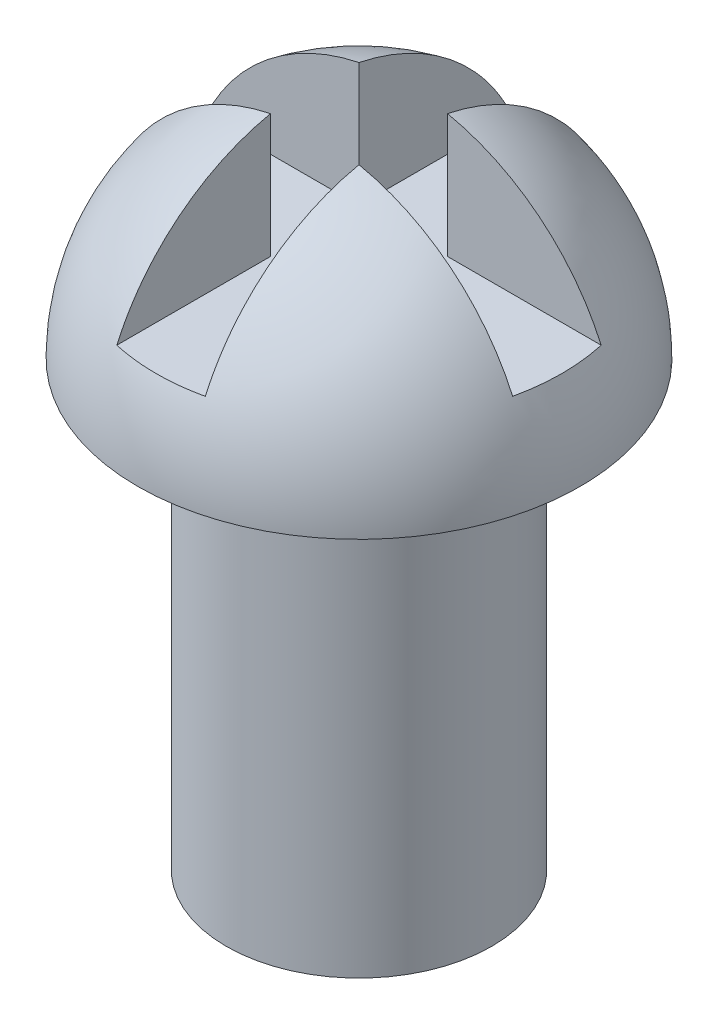
ISO-10303-21;
HEADER;
FILE_DESCRIPTION(('STEP AP214'),'2;1');
FILE_NAME('part.step','',(''),(''),'','','');
FILE_SCHEMA(('AUTOMOTIVE_DESIGN { 1 0 10303 214 1 1 1 1 }'));
ENDSEC;
DATA;
#1=APPLICATION_CONTEXT('core data for automotive mechanical design processes');
#2=APPLICATION_PROTOCOL_DEFINITION('international standard','automotive_design',2000,#1);
#3=PRODUCT_CONTEXT('',#1,'mechanical');
#4=PRODUCT('Part','Part','',(#3));
#5=PRODUCT_RELATED_PRODUCT_CATEGORY('part','',(#4));
#6=PRODUCT_DEFINITION_FORMATION('','',#4);
#7=PRODUCT_DEFINITION_CONTEXT('part definition',#1,'design');
#8=PRODUCT_DEFINITION('design','',#6,#7);
#9=PRODUCT_DEFINITION_SHAPE('','',#8);
#10=(LENGTH_UNIT() NAMED_UNIT(*) SI_UNIT(.MILLI.,.METRE.));
#11=(NAMED_UNIT(*) PLANE_ANGLE_UNIT() SI_UNIT($,.RADIAN.));
#12=(NAMED_UNIT(*) SI_UNIT($,.STERADIAN.) SOLID_ANGLE_UNIT());
#13=UNCERTAINTY_MEASURE_WITH_UNIT(LENGTH_MEASURE(1.E-05),#10,'distance_accuracy_value','');
#14=(GEOMETRIC_REPRESENTATION_CONTEXT(3) GLOBAL_UNCERTAINTY_ASSIGNED_CONTEXT((#13)) GLOBAL_UNIT_ASSIGNED_CONTEXT((#10,
#11,#12)) REPRESENTATION_CONTEXT('',''));
#15=CARTESIAN_POINT('',(0.,0.,0.));
#16=DIRECTION('',(0.,0.,1.));
#17=DIRECTION('',(1.,0.,0.));
#18=AXIS2_PLACEMENT_3D('',#15,#16,#17);
#19=CARTESIAN_POINT('',(0.,5.,0.));
#20=DIRECTION('',(0.,-1.,0.));
#21=DIRECTION('',(0.,0.,-1.));
#22=AXIS2_PLACEMENT_3D('',#19,#20,#21);
#23=CYLINDRICAL_SURFACE('',#22,1.5);
#24=CARTESIAN_POINT('',(0.,5.,0.));
#25=DIRECTION('',(0.,1.,0.));
#26=DIRECTION('',(0.,0.,1.));
#27=AXIS2_PLACEMENT_3D('',#24,#25,#26);
#28=CIRCLE('',#27,1.5);
#29=CARTESIAN_POINT('',(0.,5.,1.5));
#30=VERTEX_POINT('',#29);
#31=EDGE_CURVE('E162',#30,#30,#28,.T.);
#32=ORIENTED_EDGE('',*,*,#31,.F.);
#33=EDGE_LOOP('',(#32));
#34=FACE_BOUND('',#33,.T.);
#35=CARTESIAN_POINT('',(0.,0.,0.));
#36=DIRECTION('',(0.,1.,0.));
#37=DIRECTION('',(0.,0.,1.));
#38=AXIS2_PLACEMENT_3D('',#35,#36,#37);
#39=CIRCLE('',#38,1.5);
#40=CARTESIAN_POINT('',(0.,0.,1.5));
#41=VERTEX_POINT('',#40);
#42=EDGE_CURVE('E161',#41,#41,#39,.T.);
#43=ORIENTED_EDGE('',*,*,#42,.T.);
#44=EDGE_LOOP('',(#43));
#45=FACE_BOUND('',#44,.T.);
#46=ADVANCED_FACE('F39',(#34,#45),#23,.T.);
#47=CARTESIAN_POINT('',(0.,0.,0.));
#48=DIRECTION('',(0.,1.,0.));
#49=DIRECTION('',(0.,0.,1.));
#50=AXIS2_PLACEMENT_3D('',#47,#48,#49);
#51=PLANE('',#50);
#52=ORIENTED_EDGE('',*,*,#42,.F.);
#53=EDGE_LOOP('',(#52));
#54=FACE_BOUND('',#53,.T.);
#55=ADVANCED_FACE('F221',(#54),#51,.F.);
#56=CARTESIAN_POINT('',(0.,5.,0.));
#57=DIRECTION('',(0.,0.,-1.));
#58=DIRECTION('',(-1.,0.,0.));
#59=AXIS2_PLACEMENT_3D('',#56,#57,#58);
#60=SPHERICAL_SURFACE('',#59,2.5);
#61=CARTESIAN_POINT('',(0.,5.,-0.5));
#62=DIRECTION('',(0.,0.,-1.));
#63=DIRECTION('',(-1.,0.,0.));
#64=AXIS2_PLACEMENT_3D('',#61,#62,#63);
#65=CIRCLE('',#64,2.44948974278318);
#66=CARTESIAN_POINT('',(-2.23606797749979,6.,-0.5));
#67=VERTEX_POINT('',#66);
#68=CARTESIAN_POINT('',(-0.5,7.39791576165636,-0.5));
#69=VERTEX_POINT('',#68);
#70=EDGE_CURVE('E47',#67,#69,#65,.T.);
#71=ORIENTED_EDGE('',*,*,#70,.T.);
#72=CARTESIAN_POINT('',(-0.499999999999999,5.,0.));
#73=DIRECTION('',(-1.,0.,0.));
#74=DIRECTION('',(0.,0.,1.));
#75=AXIS2_PLACEMENT_3D('',#72,#73,#74);
#76=CIRCLE('',#75,2.44948974278318);
#77=CARTESIAN_POINT('',(-0.5,6.,-2.23606797749979));
#78=VERTEX_POINT('',#77);
#79=EDGE_CURVE('E11',#69,#78,#76,.T.);
#80=ORIENTED_EDGE('',*,*,#79,.T.);
#81=CARTESIAN_POINT('',(0.,6.,0.));
#82=DIRECTION('',(0.,1.,0.));
#83=DIRECTION('',(0.,0.,1.));
#84=AXIS2_PLACEMENT_3D('',#81,#82,#83);
#85=CIRCLE('',#84,2.29128784747792);
#86=CARTESIAN_POINT('',(0.5,6.,-2.23606797749979));
#87=VERTEX_POINT('',#86);
#88=EDGE_CURVE('E113',#87,#78,#85,.T.);
#89=ORIENTED_EDGE('',*,*,#88,.F.);
#90=CARTESIAN_POINT('',(0.5,5.,0.));
#91=DIRECTION('',(1.,0.,0.));
#92=DIRECTION('',(0.,0.,-1.));
#93=AXIS2_PLACEMENT_3D('',#90,#91,#92);
#94=CIRCLE('',#93,2.44948974278318);
#95=CARTESIAN_POINT('',(0.5,7.39791576165636,-0.5));
#96=VERTEX_POINT('',#95);
#97=EDGE_CURVE('E191',#87,#96,#94,.T.);
#98=ORIENTED_EDGE('',*,*,#97,.T.);
#99=CARTESIAN_POINT('',(0.,5.,-0.5));
#100=DIRECTION('',(0.,0.,-1.));
#101=DIRECTION('',(-1.,0.,0.));
#102=AXIS2_PLACEMENT_3D('',#99,#100,#101);
#103=CIRCLE('',#102,2.44948974278318);
#104=CARTESIAN_POINT('',(2.23606797749979,6.,-0.5));
#105=VERTEX_POINT('',#104);
#106=EDGE_CURVE('E62',#96,#105,#103,.T.);
#107=ORIENTED_EDGE('',*,*,#106,.T.);
#108=CARTESIAN_POINT('',(2.23606797749979,6.,0.5));
#109=VERTEX_POINT('',#108);
#110=EDGE_CURVE('E173',#109,#105,#85,.T.);
#111=ORIENTED_EDGE('',*,*,#110,.F.);
#112=CARTESIAN_POINT('',(0.,5.,0.5));
#113=DIRECTION('',(0.,0.,1.));
#114=DIRECTION('',(1.,0.,0.));
#115=AXIS2_PLACEMENT_3D('',#112,#113,#114);
#116=CIRCLE('',#115,2.44948974278318);
#117=CARTESIAN_POINT('',(0.5,7.39791576165636,0.5));
#118=VERTEX_POINT('',#117);
#119=EDGE_CURVE('E181',#109,#118,#116,.T.);
#120=ORIENTED_EDGE('',*,*,#119,.T.);
#121=CARTESIAN_POINT('',(0.5,5.,0.));
#122=DIRECTION('',(1.,0.,0.));
#123=DIRECTION('',(0.,0.,-1.));
#124=AXIS2_PLACEMENT_3D('',#121,#122,#123);
#125=CIRCLE('',#124,2.44948974278318);
#126=CARTESIAN_POINT('',(0.5,6.,2.23606797749979));
#127=VERTEX_POINT('',#126);
#128=EDGE_CURVE('E177',#118,#127,#125,.T.);
#129=ORIENTED_EDGE('',*,*,#128,.T.);
#130=CARTESIAN_POINT('',(-0.5,6.,2.23606797749979));
#131=VERTEX_POINT('',#130);
#132=EDGE_CURVE('E166',#131,#127,#85,.T.);
#133=ORIENTED_EDGE('',*,*,#132,.F.);
#134=CARTESIAN_POINT('',(-0.5,5.,0.));
#135=DIRECTION('',(-1.,0.,0.));
#136=DIRECTION('',(0.,0.,1.));
#137=AXIS2_PLACEMENT_3D('',#134,#135,#136);
#138=CIRCLE('',#137,2.44948974278318);
#139=CARTESIAN_POINT('',(-0.5,7.39791576165636,0.5));
#140=VERTEX_POINT('',#139);
#141=EDGE_CURVE('E172',#131,#140,#138,.T.);
#142=ORIENTED_EDGE('',*,*,#141,.T.);
#143=CARTESIAN_POINT('',(0.,5.,0.5));
#144=DIRECTION('',(0.,0.,1.));
#145=DIRECTION('',(1.,0.,0.));
#146=AXIS2_PLACEMENT_3D('',#143,#144,#145);
#147=CIRCLE('',#146,2.44948974278318);
#148=CARTESIAN_POINT('',(-2.23606797749979,6.,0.5));
#149=VERTEX_POINT('',#148);
#150=EDGE_CURVE('E185',#140,#149,#147,.T.);
#151=ORIENTED_EDGE('',*,*,#150,.T.);
#152=EDGE_CURVE('E194',#67,#149,#85,.T.);
#153=ORIENTED_EDGE('',*,*,#152,.F.);
#154=EDGE_LOOP('',(#71,#80,#89,#98,#107,#111,#120,#129,#133,#142,#151,#153));
#155=FACE_BOUND('',#154,.T.);
#156=CARTESIAN_POINT('',(0.,5.,0.));
#157=DIRECTION('',(0.,-1.,0.));
#158=DIRECTION('',(0.,0.,1.));
#159=AXIS2_PLACEMENT_3D('',#156,#157,#158);
#160=CIRCLE('',#159,2.5);
#161=CARTESIAN_POINT('',(0.,5.,2.5));
#162=VERTEX_POINT('',#161);
#163=EDGE_CURVE('E150',#162,#162,#160,.T.);
#164=ORIENTED_EDGE('',*,*,#163,.F.);
#165=EDGE_LOOP('',(#164));
#166=FACE_BOUND('',#165,.T.);
#167=ADVANCED_FACE('F205',(#155,#166),#60,.T.);
#168=CARTESIAN_POINT('',(0.,5.,0.));
#169=DIRECTION('',(0.,-1.,0.));
#170=DIRECTION('',(0.,0.,1.));
#171=AXIS2_PLACEMENT_3D('',#168,#169,#170);
#172=PLANE('',#171);
#173=ORIENTED_EDGE('',*,*,#31,.T.);
#174=EDGE_LOOP('',(#173));
#175=FACE_BOUND('',#174,.T.);
#176=ORIENTED_EDGE('',*,*,#163,.T.);
#177=EDGE_LOOP('',(#176));
#178=FACE_BOUND('',#177,.T.);
#179=ADVANCED_FACE('F217',(#175,#178),#172,.T.);
#180=CARTESIAN_POINT('',(-0.500000000000001,6.,-4.67398282875427));
#181=DIRECTION('',(-1.,0.,0.));
#182=DIRECTION('',(0.,0.,1.));
#183=AXIS2_PLACEMENT_3D('',#180,#181,#182);
#184=PLANE('',#183);
#185=DIRECTION('',(0.,1.,0.));
#186=VECTOR('',#185,1.);
#187=CARTESIAN_POINT('',(-0.5,6.,-0.5));
#188=LINE('',#187,#186);
#189=CARTESIAN_POINT('',(-0.5,6.,-0.5));
#190=VERTEX_POINT('',#189);
#191=EDGE_CURVE('E118',#190,#69,#188,.T.);
#192=ORIENTED_EDGE('',*,*,#191,.F.);
#193=DIRECTION('',(0.,0.,1.));
#194=VECTOR('',#193,1.);
#195=CARTESIAN_POINT('',(-0.500000000000001,6.,-4.67398282875427));
#196=LINE('',#195,#194);
#197=EDGE_CURVE('E105',#78,#190,#196,.T.);
#198=ORIENTED_EDGE('',*,*,#197,.F.);
#199=ORIENTED_EDGE('',*,*,#79,.F.);
#200=EDGE_LOOP('',(#192,#198,#199));
#201=FACE_BOUND('',#200,.T.);
#202=ADVANCED_FACE('F119',(#201),#184,.F.);
#203=CARTESIAN_POINT('',(0.499999999999999,6.,-4.67398282875427));
#204=DIRECTION('',(1.,0.,0.));
#205=DIRECTION('',(0.,0.,-1.));
#206=AXIS2_PLACEMENT_3D('',#203,#204,#205);
#207=PLANE('',#206);
#208=DIRECTION('',(0.,0.,-1.));
#209=VECTOR('',#208,1.);
#210=CARTESIAN_POINT('',(0.499999999999999,6.,-4.67398282875427));
#211=LINE('',#210,#209);
#212=CARTESIAN_POINT('',(0.5,6.,-0.5));
#213=VERTEX_POINT('',#212);
#214=EDGE_CURVE('E124',#213,#87,#211,.T.);
#215=ORIENTED_EDGE('',*,*,#214,.F.);
#216=DIRECTION('',(0.,1.,0.));
#217=VECTOR('',#216,1.);
#218=CARTESIAN_POINT('',(0.5,6.,-0.5));
#219=LINE('',#218,#217);
#220=EDGE_CURVE('E147',#213,#96,#219,.T.);
#221=ORIENTED_EDGE('',*,*,#220,.T.);
#222=ORIENTED_EDGE('',*,*,#97,.F.);
#223=EDGE_LOOP('',(#215,#221,#222));
#224=FACE_BOUND('',#223,.T.);
#225=ADVANCED_FACE('F208',(#224),#207,.F.);
#226=CARTESIAN_POINT('',(0.5,6.,-0.5));
#227=DIRECTION('',(0.,0.,-1.));
#228=DIRECTION('',(-1.,0.,0.));
#229=AXIS2_PLACEMENT_3D('',#226,#227,#228);
#230=PLANE('',#229);
#231=ORIENTED_EDGE('',*,*,#220,.F.);
#232=DIRECTION('',(-1.,0.,0.));
#233=VECTOR('',#232,1.);
#234=CARTESIAN_POINT('',(0.5,6.,-0.5));
#235=LINE('',#234,#233);
#236=EDGE_CURVE('E142',#105,#213,#235,.T.);
#237=ORIENTED_EDGE('',*,*,#236,.F.);
#238=ORIENTED_EDGE('',*,*,#106,.F.);
#239=EDGE_LOOP('',(#231,#237,#238));
#240=FACE_BOUND('',#239,.T.);
#241=ADVANCED_FACE('F203',(#240),#230,.F.);
#242=CARTESIAN_POINT('',(0.5,6.,0.5));
#243=DIRECTION('',(0.,0.,1.));
#244=DIRECTION('',(1.,0.,0.));
#245=AXIS2_PLACEMENT_3D('',#242,#243,#244);
#246=PLANE('',#245);
#247=DIRECTION('',(1.,0.,0.));
#248=VECTOR('',#247,1.);
#249=CARTESIAN_POINT('',(0.5,6.,0.5));
#250=LINE('',#249,#248);
#251=CARTESIAN_POINT('',(0.5,6.,0.5));
#252=VERTEX_POINT('',#251);
#253=EDGE_CURVE('E138',#252,#109,#250,.T.);
#254=ORIENTED_EDGE('',*,*,#253,.F.);
#255=DIRECTION('',(0.,1.,0.));
#256=VECTOR('',#255,1.);
#257=CARTESIAN_POINT('',(0.5,6.,0.5));
#258=LINE('',#257,#256);
#259=EDGE_CURVE('E151',#252,#118,#258,.T.);
#260=ORIENTED_EDGE('',*,*,#259,.T.);
#261=ORIENTED_EDGE('',*,*,#119,.F.);
#262=EDGE_LOOP('',(#254,#260,#261));
#263=FACE_BOUND('',#262,.T.);
#264=ADVANCED_FACE('F215',(#263),#246,.F.);
#265=CARTESIAN_POINT('',(0.5,6.,0.5));
#266=DIRECTION('',(1.,0.,0.));
#267=DIRECTION('',(0.,0.,-1.));
#268=AXIS2_PLACEMENT_3D('',#265,#266,#267);
#269=PLANE('',#268);
#270=ORIENTED_EDGE('',*,*,#259,.F.);
#271=DIRECTION('',(0.,0.,-1.));
#272=VECTOR('',#271,1.);
#273=CARTESIAN_POINT('',(0.5,6.,0.5));
#274=LINE('',#273,#272);
#275=EDGE_CURVE('E135',#127,#252,#274,.T.);
#276=ORIENTED_EDGE('',*,*,#275,.F.);
#277=ORIENTED_EDGE('',*,*,#128,.F.);
#278=EDGE_LOOP('',(#270,#276,#277));
#279=FACE_BOUND('',#278,.T.);
#280=ADVANCED_FACE('F249',(#279),#269,.F.);
#281=CARTESIAN_POINT('',(-0.5,6.,0.5));
#282=DIRECTION('',(-1.,0.,0.));
#283=DIRECTION('',(0.,0.,1.));
#284=AXIS2_PLACEMENT_3D('',#281,#282,#283);
#285=PLANE('',#284);
#286=DIRECTION('',(0.,0.,1.));
#287=VECTOR('',#286,1.);
#288=CARTESIAN_POINT('',(-0.5,6.,0.5));
#289=LINE('',#288,#287);
#290=CARTESIAN_POINT('',(-0.5,6.,0.5));
#291=VERTEX_POINT('',#290);
#292=EDGE_CURVE('E54',#291,#131,#289,.T.);
#293=ORIENTED_EDGE('',*,*,#292,.F.);
#294=DIRECTION('',(0.,1.,0.));
#295=VECTOR('',#294,1.);
#296=CARTESIAN_POINT('',(-0.5,6.,0.5));
#297=LINE('',#296,#295);
#298=EDGE_CURVE('E123',#291,#140,#297,.T.);
#299=ORIENTED_EDGE('',*,*,#298,.T.);
#300=ORIENTED_EDGE('',*,*,#141,.F.);
#301=EDGE_LOOP('',(#293,#299,#300));
#302=FACE_BOUND('',#301,.T.);
#303=ADVANCED_FACE('F245',(#302),#285,.F.);
#304=CARTESIAN_POINT('',(-4.83332315246177,6.,0.5));
#305=DIRECTION('',(0.,0.,1.));
#306=DIRECTION('',(1.,0.,0.));
#307=AXIS2_PLACEMENT_3D('',#304,#305,#306);
#308=PLANE('',#307);
#309=ORIENTED_EDGE('',*,*,#298,.F.);
#310=DIRECTION('',(1.,0.,0.));
#311=VECTOR('',#310,1.);
#312=CARTESIAN_POINT('',(-4.83332315246177,6.,0.5));
#313=LINE('',#312,#311);
#314=EDGE_CURVE('E128',#149,#291,#313,.T.);
#315=ORIENTED_EDGE('',*,*,#314,.F.);
#316=ORIENTED_EDGE('',*,*,#150,.F.);
#317=EDGE_LOOP('',(#309,#315,#316));
#318=FACE_BOUND('',#317,.T.);
#319=ADVANCED_FACE('F242',(#318),#308,.F.);
#320=CARTESIAN_POINT('',(-4.83332315246177,6.,-0.5));
#321=DIRECTION('',(0.,0.,-1.));
#322=DIRECTION('',(-1.,0.,0.));
#323=AXIS2_PLACEMENT_3D('',#320,#321,#322);
#324=PLANE('',#323);
#325=DIRECTION('',(-1.,0.,0.));
#326=VECTOR('',#325,1.);
#327=CARTESIAN_POINT('',(-4.83332315246177,6.,-0.5));
#328=LINE('',#327,#326);
#329=EDGE_CURVE('E109',#190,#67,#328,.T.);
#330=ORIENTED_EDGE('',*,*,#329,.F.);
#331=ORIENTED_EDGE('',*,*,#191,.T.);
#332=ORIENTED_EDGE('',*,*,#70,.F.);
#333=EDGE_LOOP('',(#330,#331,#332));
#334=FACE_BOUND('',#333,.T.);
#335=ADVANCED_FACE('F126',(#334),#324,.F.);
#336=CARTESIAN_POINT('',(0.,6.,0.));
#337=DIRECTION('',(0.,1.,0.));
#338=DIRECTION('',(0.,0.,1.));
#339=AXIS2_PLACEMENT_3D('',#336,#337,#338);
#340=PLANE('',#339);
#341=ORIENTED_EDGE('',*,*,#110,.T.);
#342=ORIENTED_EDGE('',*,*,#236,.T.);
#343=ORIENTED_EDGE('',*,*,#214,.T.);
#344=ORIENTED_EDGE('',*,*,#88,.T.);
#345=ORIENTED_EDGE('',*,*,#197,.T.);
#346=ORIENTED_EDGE('',*,*,#329,.T.);
#347=ORIENTED_EDGE('',*,*,#152,.T.);
#348=ORIENTED_EDGE('',*,*,#314,.T.);
#349=ORIENTED_EDGE('',*,*,#292,.T.);
#350=ORIENTED_EDGE('',*,*,#132,.T.);
#351=ORIENTED_EDGE('',*,*,#275,.T.);
#352=ORIENTED_EDGE('',*,*,#253,.T.);
#353=EDGE_LOOP('',(#341,#342,#343,#344,#345,#346,#347,#348,#349,#350,#351,#352));
#354=FACE_BOUND('',#353,.T.);
#355=ADVANCED_FACE('F107',(#354),#340,.T.);
#356=CLOSED_SHELL('',(#46,#55,#167,#179,#202,#225,#241,#264,#280,#303,#319,#335,#355));
#357=MANIFOLD_SOLID_BREP('B2',#356);
#358=ADVANCED_BREP_SHAPE_REPRESENTATION('',(#18,#357),#14);
#359=SHAPE_DEFINITION_REPRESENTATION(#9,#358);
ENDSEC;
END-ISO-10303-21;
